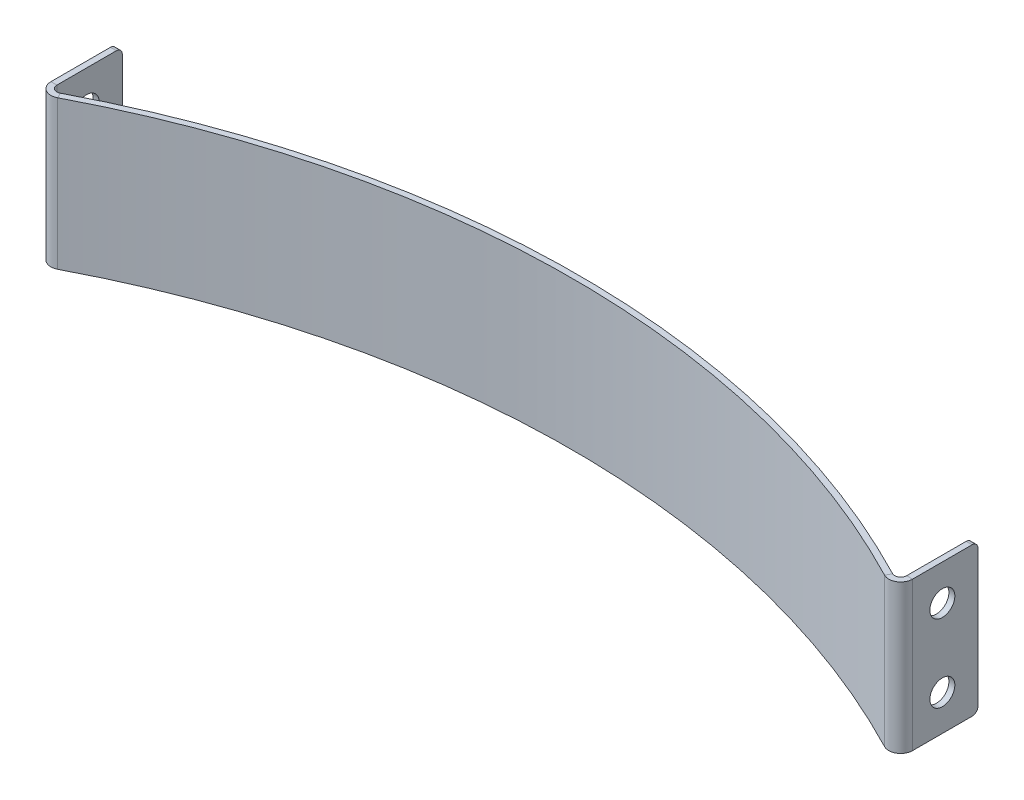
ISO-10303-21;
HEADER;
FILE_DESCRIPTION(('STEP AP214'),'2;1');
FILE_NAME('part.step','',(''),(''),'','','');
FILE_SCHEMA(('AUTOMOTIVE_DESIGN { 1 0 10303 214 1 1 1 1 }'));
ENDSEC;
DATA;
#1=APPLICATION_CONTEXT('core data for automotive mechanical design processes');
#2=APPLICATION_PROTOCOL_DEFINITION('international standard','automotive_design',2000,#1);
#3=PRODUCT_CONTEXT('',#1,'mechanical');
#4=PRODUCT('Part','Part','',(#3));
#5=PRODUCT_RELATED_PRODUCT_CATEGORY('part','',(#4));
#6=PRODUCT_DEFINITION_FORMATION('','',#4);
#7=PRODUCT_DEFINITION_CONTEXT('part definition',#1,'design');
#8=PRODUCT_DEFINITION('design','',#6,#7);
#9=PRODUCT_DEFINITION_SHAPE('','',#8);
#10=(LENGTH_UNIT() NAMED_UNIT(*) SI_UNIT(.MILLI.,.METRE.));
#11=(NAMED_UNIT(*) PLANE_ANGLE_UNIT() SI_UNIT($,.RADIAN.));
#12=(NAMED_UNIT(*) SI_UNIT($,.STERADIAN.) SOLID_ANGLE_UNIT());
#13=UNCERTAINTY_MEASURE_WITH_UNIT(LENGTH_MEASURE(1.E-05),#10,'distance_accuracy_value','');
#14=(GEOMETRIC_REPRESENTATION_CONTEXT(3) GLOBAL_UNCERTAINTY_ASSIGNED_CONTEXT((#13)) GLOBAL_UNIT_ASSIGNED_CONTEXT((#10,
#11,#12)) REPRESENTATION_CONTEXT('',''));
#15=CARTESIAN_POINT('',(0.,0.,0.));
#16=DIRECTION('',(0.,0.,1.));
#17=DIRECTION('',(1.,0.,0.));
#18=AXIS2_PLACEMENT_3D('',#15,#16,#17);
#19=CARTESIAN_POINT('',(8.04911692853238E-13,50.,4.44089209850063E-13));
#20=DIRECTION('',(0.,1.,0.));
#21=DIRECTION('',(-0.887512149902485,0.,-0.460784313725488));
#22=AXIS2_PLACEMENT_3D('',#19,#20,#21);
#23=PLANE('',#22);
#24=DIRECTION('',(0.460784313725494,0.,0.887512149902482));
#25=VECTOR('',#24,1.);
#26=CARTESIAN_POINT('',(-140.07843137255,50.,-269.803693570353));
#27=LINE('',#26,#25);
#28=CARTESIAN_POINT('',(-140.07843137255,50.,-269.803693570353));
#29=VERTEX_POINT('',#28);
#30=CARTESIAN_POINT('',(-139.156862745099,50.,-268.02866927055));
#31=VERTEX_POINT('',#30);
#32=EDGE_CURVE('E212',#29,#31,#27,.T.);
#33=ORIENTED_EDGE('',*,*,#32,.T.);
#34=CARTESIAN_POINT('',(8.04911692853238E-13,50.,4.44089209850063E-13));
#35=DIRECTION('',(0.,1.,0.));
#36=DIRECTION('',(-0.887512149902485,0.,-0.460784313725488));
#37=AXIS2_PLACEMENT_3D('',#34,#35,#36);
#38=CIRCLE('',#37,302.);
#39=CARTESIAN_POINT('',(139.156862745098,50.,-268.02866927055));
#40=VERTEX_POINT('',#39);
#41=EDGE_CURVE('E227',#31,#40,#38,.F.);
#42=ORIENTED_EDGE('',*,*,#41,.T.);
#43=DIRECTION('',(0.460784313725494,0.,-0.887512149902482));
#44=VECTOR('',#43,1.);
#45=CARTESIAN_POINT('',(139.156862745098,50.,-268.02866927055));
#46=LINE('',#45,#44);
#47=CARTESIAN_POINT('',(140.078431372549,50.,-269.803693570355));
#48=VERTEX_POINT('',#47);
#49=EDGE_CURVE('E193',#40,#48,#46,.T.);
#50=ORIENTED_EDGE('',*,*,#49,.T.);
#51=CARTESIAN_POINT('',(8.04911692853238E-13,50.,4.44089209850063E-13));
#52=DIRECTION('',(0.,-1.,0.));
#53=DIRECTION('',(0.887512149902485,0.,0.460784313725488));
#54=AXIS2_PLACEMENT_3D('',#51,#52,#53);
#55=CIRCLE('',#54,304.);
#56=EDGE_CURVE('E216',#29,#48,#55,.T.);
#57=ORIENTED_EDGE('',*,*,#56,.F.);
#58=EDGE_LOOP('',(#33,#42,#50,#57));
#59=FACE_BOUND('',#58,.T.);
#60=ADVANCED_FACE('F47',(#59),#23,.T.);
#61=CARTESIAN_POINT('',(8.04911692853238E-13,0.,4.44089209850063E-13));
#62=DIRECTION('',(0.,-1.,0.));
#63=DIRECTION('',(0.887512149902485,0.,0.460784313725488));
#64=AXIS2_PLACEMENT_3D('',#61,#62,#63);
#65=PLANE('',#64);
#66=DIRECTION('',(-0.460784313725494,0.,0.887512149902482));
#67=VECTOR('',#66,1.);
#68=CARTESIAN_POINT('',(140.078431372549,0.,-269.803693570355));
#69=LINE('',#68,#67);
#70=CARTESIAN_POINT('',(140.078431372549,0.,-269.803693570355));
#71=VERTEX_POINT('',#70);
#72=CARTESIAN_POINT('',(139.156862745098,0.,-268.02866927055));
#73=VERTEX_POINT('',#72);
#74=EDGE_CURVE('E11',#71,#73,#69,.T.);
#75=ORIENTED_EDGE('',*,*,#74,.T.);
#76=CARTESIAN_POINT('',(8.04911692853238E-13,0.,4.44089209850063E-13));
#77=DIRECTION('',(0.,1.,0.));
#78=DIRECTION('',(-0.887512149902485,0.,-0.460784313725488));
#79=AXIS2_PLACEMENT_3D('',#76,#77,#78);
#80=CIRCLE('',#79,302.);
#81=CARTESIAN_POINT('',(-139.156862745096,0.,-268.028669270549));
#82=VERTEX_POINT('',#81);
#83=EDGE_CURVE('E223',#73,#82,#80,.T.);
#84=ORIENTED_EDGE('',*,*,#83,.T.);
#85=DIRECTION('',(-0.460784313725494,0.,-0.887512149902482));
#86=VECTOR('',#85,1.);
#87=CARTESIAN_POINT('',(-139.156862745099,0.,-268.028669270548));
#88=LINE('',#87,#86);
#89=CARTESIAN_POINT('',(-140.078431372549,0.,-269.803693570353));
#90=VERTEX_POINT('',#89);
#91=EDGE_CURVE('E238',#82,#90,#88,.T.);
#92=ORIENTED_EDGE('',*,*,#91,.T.);
#93=CARTESIAN_POINT('',(8.04911692853238E-13,0.,4.44089209850063E-13));
#94=DIRECTION('',(0.,1.,0.));
#95=DIRECTION('',(-0.887512149902485,0.,-0.460784313725488));
#96=AXIS2_PLACEMENT_3D('',#93,#94,#95);
#97=CIRCLE('',#96,304.);
#98=EDGE_CURVE('E222',#71,#90,#97,.T.);
#99=ORIENTED_EDGE('',*,*,#98,.F.);
#100=EDGE_LOOP('',(#75,#84,#92,#99));
#101=FACE_BOUND('',#100,.T.);
#102=ADVANCED_FACE('F432',(#101),#65,.T.);
#103=CARTESIAN_POINT('',(8.04911692853238E-13,-269.483160619369,4.44089209850063E-13));
#104=DIRECTION('',(0.,1.,0.));
#105=DIRECTION('',(-0.887512149902485,0.,-0.460784313725488));
#106=AXIS2_PLACEMENT_3D('',#103,#104,#105);
#107=CYLINDRICAL_SURFACE('',#106,304.);
#108=ORIENTED_EDGE('',*,*,#98,.T.);
#109=DIRECTION('',(0.,-1.,0.));
#110=VECTOR('',#109,1.);
#111=CARTESIAN_POINT('',(-140.07843137255,50.,-269.803693570353));
#112=LINE('',#111,#110);
#113=EDGE_CURVE('E218',#29,#90,#112,.T.);
#114=ORIENTED_EDGE('',*,*,#113,.F.);
#115=ORIENTED_EDGE('',*,*,#56,.T.);
#116=DIRECTION('',(0.,-1.,0.));
#117=VECTOR('',#116,1.);
#118=CARTESIAN_POINT('',(140.078431372549,50.,-269.803693570355));
#119=LINE('',#118,#117);
#120=EDGE_CURVE('E204',#48,#71,#119,.T.);
#121=ORIENTED_EDGE('',*,*,#120,.T.);
#122=EDGE_LOOP('',(#108,#114,#115,#121));
#123=FACE_BOUND('',#122,.T.);
#124=ADVANCED_FACE('F217',(#123),#107,.T.);
#125=CARTESIAN_POINT('',(8.04911692853238E-13,-269.483160619369,4.44089209850063E-13));
#126=DIRECTION('',(0.,1.,0.));
#127=DIRECTION('',(-0.887512149902485,0.,-0.460784313725488));
#128=AXIS2_PLACEMENT_3D('',#125,#126,#127);
#129=CYLINDRICAL_SURFACE('',#128,302.);
#130=ORIENTED_EDGE('',*,*,#83,.F.);
#131=DIRECTION('',(0.,-1.,0.));
#132=VECTOR('',#131,1.);
#133=CARTESIAN_POINT('',(139.156862745098,50.,-268.02866927055));
#134=LINE('',#133,#132);
#135=EDGE_CURVE('E55',#40,#73,#134,.T.);
#136=ORIENTED_EDGE('',*,*,#135,.F.);
#137=ORIENTED_EDGE('',*,*,#41,.F.);
#138=DIRECTION('',(0.,-1.,0.));
#139=VECTOR('',#138,1.);
#140=CARTESIAN_POINT('',(-139.156862745099,50.,-268.028669270548));
#141=LINE('',#140,#139);
#142=EDGE_CURVE('E234',#31,#82,#141,.T.);
#143=ORIENTED_EDGE('',*,*,#142,.T.);
#144=EDGE_LOOP('',(#130,#136,#137,#143));
#145=FACE_BOUND('',#144,.T.);
#146=ADVANCED_FACE('F430',(#145),#129,.F.);
#147=CARTESIAN_POINT('',(-141.000000000001,50.,-271.578717870158));
#148=DIRECTION('',(0.,-1.,0.));
#149=DIRECTION('',(0.887512149902485,0.,0.460784313725488));
#150=AXIS2_PLACEMENT_3D('',#147,#148,#149);
#151=PLANE('',#150);
#152=DIRECTION('',(1.,0.,0.));
#153=VECTOR('',#152,1.);
#154=CARTESIAN_POINT('',(-145.000000000001,50.,-271.578717870158));
#155=LINE('',#154,#153);
#156=CARTESIAN_POINT('',(-145.000000000001,50.,-271.578717870158));
#157=VERTEX_POINT('',#156);
#158=CARTESIAN_POINT('',(-143.000000000001,50.,-271.578717870158));
#159=VERTEX_POINT('',#158);
#160=EDGE_CURVE('E254',#157,#159,#155,.T.);
#161=ORIENTED_EDGE('',*,*,#160,.F.);
#162=CARTESIAN_POINT('',(-141.000000000001,50.,-271.578717870158));
#163=DIRECTION('',(0.,1.,0.));
#164=DIRECTION('',(-0.887512149902485,0.,-0.460784313725488));
#165=AXIS2_PLACEMENT_3D('',#162,#163,#164);
#166=CIRCLE('',#165,4.);
#167=EDGE_CURVE('E72',#157,#31,#166,.T.);
#168=ORIENTED_EDGE('',*,*,#167,.T.);
#169=ORIENTED_EDGE('',*,*,#32,.F.);
#170=CARTESIAN_POINT('',(-141.000000000001,50.,-271.578717870158));
#171=DIRECTION('',(0.,1.,0.));
#172=DIRECTION('',(-0.887512149902485,0.,-0.460784313725488));
#173=AXIS2_PLACEMENT_3D('',#170,#171,#172);
#174=CIRCLE('',#173,2.);
#175=EDGE_CURVE('E258',#159,#29,#174,.T.);
#176=ORIENTED_EDGE('',*,*,#175,.F.);
#177=EDGE_LOOP('',(#161,#168,#169,#176));
#178=FACE_BOUND('',#177,.T.);
#179=ADVANCED_FACE('F447',(#178),#151,.F.);
#180=CARTESIAN_POINT('',(-141.000000000001,0.,-271.578717870158));
#181=DIRECTION('',(0.,1.,0.));
#182=DIRECTION('',(-0.887512149902485,0.,-0.460784313725488));
#183=AXIS2_PLACEMENT_3D('',#180,#181,#182);
#184=PLANE('',#183);
#185=ORIENTED_EDGE('',*,*,#91,.F.);
#186=CARTESIAN_POINT('',(-141.000000000001,0.,-271.578717870158));
#187=DIRECTION('',(0.,1.,0.));
#188=DIRECTION('',(-0.887512149902485,0.,-0.460784313725488));
#189=AXIS2_PLACEMENT_3D('',#186,#187,#188);
#190=CIRCLE('',#189,4.);
#191=CARTESIAN_POINT('',(-145.000000000001,0.,-271.578717870158));
#192=VERTEX_POINT('',#191);
#193=EDGE_CURVE('E253',#82,#192,#190,.F.);
#194=ORIENTED_EDGE('',*,*,#193,.T.);
#195=DIRECTION('',(-1.,0.,0.));
#196=VECTOR('',#195,1.);
#197=CARTESIAN_POINT('',(-143.000000000001,0.,-271.578717870158));
#198=LINE('',#197,#196);
#199=CARTESIAN_POINT('',(-143.000000000001,0.,-271.578717870158));
#200=VERTEX_POINT('',#199);
#201=EDGE_CURVE('E316',#200,#192,#198,.T.);
#202=ORIENTED_EDGE('',*,*,#201,.F.);
#203=CARTESIAN_POINT('',(-141.000000000001,0.,-271.578717870158));
#204=DIRECTION('',(0.,-1.,0.));
#205=DIRECTION('',(0.887512149902485,0.,0.460784313725488));
#206=AXIS2_PLACEMENT_3D('',#203,#204,#205);
#207=CIRCLE('',#206,2.);
#208=EDGE_CURVE('E246',#90,#200,#207,.T.);
#209=ORIENTED_EDGE('',*,*,#208,.F.);
#210=EDGE_LOOP('',(#185,#194,#202,#209));
#211=FACE_BOUND('',#210,.T.);
#212=ADVANCED_FACE('F436',(#211),#184,.F.);
#213=CARTESIAN_POINT('',(-141.000000000001,-25.6454305624721,-271.578717870158));
#214=DIRECTION('',(0.,1.,0.));
#215=DIRECTION('',(-0.887512149902485,0.,-0.460784313725488));
#216=AXIS2_PLACEMENT_3D('',#213,#214,#215);
#217=CYLINDRICAL_SURFACE('',#216,2.);
#218=ORIENTED_EDGE('',*,*,#208,.T.);
#219=DIRECTION('',(0.,-1.,0.));
#220=VECTOR('',#219,1.);
#221=CARTESIAN_POINT('',(-143.000000000001,50.,-271.578717870158));
#222=LINE('',#221,#220);
#223=EDGE_CURVE('E305',#159,#200,#222,.T.);
#224=ORIENTED_EDGE('',*,*,#223,.F.);
#225=ORIENTED_EDGE('',*,*,#175,.T.);
#226=ORIENTED_EDGE('',*,*,#113,.T.);
#227=EDGE_LOOP('',(#218,#224,#225,#226));
#228=FACE_BOUND('',#227,.T.);
#229=ADVANCED_FACE('F469',(#228),#217,.F.);
#230=CARTESIAN_POINT('',(-141.000000000001,-25.6454305624721,-271.578717870158));
#231=DIRECTION('',(0.,1.,0.));
#232=DIRECTION('',(-0.887512149902485,0.,-0.460784313725488));
#233=AXIS2_PLACEMENT_3D('',#230,#231,#232);
#234=CYLINDRICAL_SURFACE('',#233,4.);
#235=ORIENTED_EDGE('',*,*,#193,.F.);
#236=ORIENTED_EDGE('',*,*,#142,.F.);
#237=ORIENTED_EDGE('',*,*,#167,.F.);
#238=DIRECTION('',(0.,-1.,0.));
#239=VECTOR('',#238,1.);
#240=CARTESIAN_POINT('',(-145.000000000001,50.,-271.578717870158));
#241=LINE('',#240,#239);
#242=EDGE_CURVE('E264',#157,#192,#241,.T.);
#243=ORIENTED_EDGE('',*,*,#242,.T.);
#244=EDGE_LOOP('',(#235,#236,#237,#243));
#245=FACE_BOUND('',#244,.T.);
#246=ADVANCED_FACE('F439',(#245),#234,.T.);
#247=CARTESIAN_POINT('',(-145.000000000001,48.,-291.609999999998));
#248=DIRECTION('',(1.,0.,0.));
#249=DIRECTION('',(0.,0.,-1.));
#250=AXIS2_PLACEMENT_3D('',#247,#248,#249);
#251=CYLINDRICAL_SURFACE('',#250,2.);
#252=CARTESIAN_POINT('',(-145.000000000001,48.,-291.609999999998));
#253=DIRECTION('',(1.,0.,0.));
#254=DIRECTION('',(0.,0.,-1.));
#255=AXIS2_PLACEMENT_3D('',#252,#253,#254);
#256=CIRCLE('',#255,2.);
#257=CARTESIAN_POINT('',(-145.000000000001,50.,-291.609999999998));
#258=VERTEX_POINT('',#257);
#259=CARTESIAN_POINT('',(-145.000000000001,48.,-293.609999999998));
#260=VERTEX_POINT('',#259);
#261=EDGE_CURVE('E330',#258,#260,#256,.F.);
#262=ORIENTED_EDGE('',*,*,#261,.F.);
#263=DIRECTION('',(1.,0.,0.));
#264=VECTOR('',#263,1.);
#265=CARTESIAN_POINT('',(-140.07843137255,50.,-291.609999999998));
#266=LINE('',#265,#264);
#267=CARTESIAN_POINT('',(-143.000000000001,50.,-291.609999999998));
#268=VERTEX_POINT('',#267);
#269=EDGE_CURVE('E333',#268,#258,#266,.F.);
#270=ORIENTED_EDGE('',*,*,#269,.F.);
#271=CARTESIAN_POINT('',(-143.000000000001,48.,-291.609999999998));
#272=DIRECTION('',(1.,0.,0.));
#273=DIRECTION('',(0.,0.,-1.));
#274=AXIS2_PLACEMENT_3D('',#271,#272,#273);
#275=CIRCLE('',#274,2.);
#276=CARTESIAN_POINT('',(-143.000000000001,48.,-293.609999999998));
#277=VERTEX_POINT('',#276);
#278=EDGE_CURVE('E299',#277,#268,#275,.T.);
#279=ORIENTED_EDGE('',*,*,#278,.F.);
#280=DIRECTION('',(1.,0.,0.));
#281=VECTOR('',#280,1.);
#282=CARTESIAN_POINT('',(-145.000000000001,48.,-293.609999999998));
#283=LINE('',#282,#281);
#284=EDGE_CURVE('E276',#260,#277,#283,.T.);
#285=ORIENTED_EDGE('',*,*,#284,.F.);
#286=EDGE_LOOP('',(#262,#270,#279,#285));
#287=FACE_BOUND('',#286,.T.);
#288=ADVANCED_FACE('F454',(#287),#251,.T.);
#289=CARTESIAN_POINT('',(-145.000000000001,50.,-293.609999999998));
#290=DIRECTION('',(0.,0.,-1.));
#291=DIRECTION('',(-1.,0.,0.));
#292=AXIS2_PLACEMENT_3D('',#289,#290,#291);
#293=PLANE('',#292);
#294=DIRECTION('',(0.,-1.,0.));
#295=VECTOR('',#294,1.);
#296=CARTESIAN_POINT('',(-143.000000000001,50.,-293.609999999998));
#297=LINE('',#296,#295);
#298=CARTESIAN_POINT('',(-143.000000000001,1.99999999999999,-293.609999999998));
#299=VERTEX_POINT('',#298);
#300=EDGE_CURVE('E268',#277,#299,#297,.T.);
#301=ORIENTED_EDGE('',*,*,#300,.T.);
#302=DIRECTION('',(1.,0.,0.));
#303=VECTOR('',#302,1.);
#304=CARTESIAN_POINT('',(-145.000000000001,2.,-293.609999999998));
#305=LINE('',#304,#303);
#306=CARTESIAN_POINT('',(-145.000000000001,1.99999999999999,-293.609999999998));
#307=VERTEX_POINT('',#306);
#308=EDGE_CURVE('E273',#299,#307,#305,.F.);
#309=ORIENTED_EDGE('',*,*,#308,.T.);
#310=DIRECTION('',(0.,-1.,0.));
#311=VECTOR('',#310,1.);
#312=CARTESIAN_POINT('',(-145.000000000001,50.,-293.609999999998));
#313=LINE('',#312,#311);
#314=EDGE_CURVE('E320',#260,#307,#313,.T.);
#315=ORIENTED_EDGE('',*,*,#314,.F.);
#316=ORIENTED_EDGE('',*,*,#284,.T.);
#317=EDGE_LOOP('',(#301,#309,#315,#316));
#318=FACE_BOUND('',#317,.T.);
#319=ADVANCED_FACE('F459',(#318),#293,.T.);
#320=CARTESIAN_POINT('',(140.999999999999,2.,-291.609999999998));
#321=DIRECTION('',(-1.,0.,0.));
#322=DIRECTION('',(0.,0.,1.));
#323=AXIS2_PLACEMENT_3D('',#320,#321,#322);
#324=CYLINDRICAL_SURFACE('',#323,2.);
#325=CARTESIAN_POINT('',(-145.000000000001,2.,-291.609999999998));
#326=DIRECTION('',(1.,0.,0.));
#327=DIRECTION('',(0.,0.,-1.));
#328=AXIS2_PLACEMENT_3D('',#325,#326,#327);
#329=CIRCLE('',#328,2.);
#330=CARTESIAN_POINT('',(-145.000000000001,0.,-291.609999999998));
#331=VERTEX_POINT('',#330);
#332=EDGE_CURVE('E324',#307,#331,#329,.F.);
#333=ORIENTED_EDGE('',*,*,#332,.F.);
#334=ORIENTED_EDGE('',*,*,#308,.F.);
#335=CARTESIAN_POINT('',(-143.000000000001,2.,-291.609999999998));
#336=DIRECTION('',(1.,0.,0.));
#337=DIRECTION('',(0.,0.,-1.));
#338=AXIS2_PLACEMENT_3D('',#335,#336,#337);
#339=CIRCLE('',#338,2.);
#340=CARTESIAN_POINT('',(-143.000000000001,0.,-291.609999999998));
#341=VERTEX_POINT('',#340);
#342=EDGE_CURVE('E296',#341,#299,#339,.T.);
#343=ORIENTED_EDGE('',*,*,#342,.F.);
#344=DIRECTION('',(1.,0.,0.));
#345=VECTOR('',#344,1.);
#346=CARTESIAN_POINT('',(-143.000000000001,0.,-291.609999999998));
#347=LINE('',#346,#345);
#348=EDGE_CURVE('E308',#331,#341,#347,.T.);
#349=ORIENTED_EDGE('',*,*,#348,.F.);
#350=EDGE_LOOP('',(#333,#334,#343,#349));
#351=FACE_BOUND('',#350,.T.);
#352=ADVANCED_FACE('F463',(#351),#324,.T.);
#353=CARTESIAN_POINT('',(-145.000000000001,38.,-281.609999999998));
#354=DIRECTION('',(-1.,0.,0.));
#355=DIRECTION('',(0.,0.,1.));
#356=AXIS2_PLACEMENT_3D('',#353,#354,#355);
#357=CYLINDRICAL_SURFACE('',#356,4.2);
#358=CARTESIAN_POINT('',(-145.000000000001,38.,-281.609999999998));
#359=DIRECTION('',(-1.,0.,0.));
#360=DIRECTION('',(0.,0.,1.));
#361=AXIS2_PLACEMENT_3D('',#358,#359,#360);
#362=CIRCLE('',#361,4.19999999999999);
#363=CARTESIAN_POINT('',(-145.000000000001,38.,-277.409999999998));
#364=VERTEX_POINT('',#363);
#365=EDGE_CURVE('E280',#364,#364,#362,.T.);
#366=ORIENTED_EDGE('',*,*,#365,.T.);
#367=EDGE_LOOP('',(#366));
#368=FACE_BOUND('',#367,.T.);
#369=CARTESIAN_POINT('',(-143.000000000001,38.,-281.609999999998));
#370=DIRECTION('',(1.,0.,0.));
#371=DIRECTION('',(0.,0.,-1.));
#372=AXIS2_PLACEMENT_3D('',#369,#370,#371);
#373=CIRCLE('',#372,4.2);
#374=CARTESIAN_POINT('',(-143.000000000001,38.,-285.809999999998));
#375=VERTEX_POINT('',#374);
#376=EDGE_CURVE('E284',#375,#375,#373,.T.);
#377=ORIENTED_EDGE('',*,*,#376,.T.);
#378=EDGE_LOOP('',(#377));
#379=FACE_BOUND('',#378,.T.);
#380=ADVANCED_FACE('F481',(#368,#379),#357,.F.);
#381=CARTESIAN_POINT('',(-145.000000000001,12.,-281.609999999998));
#382=DIRECTION('',(-1.,0.,0.));
#383=DIRECTION('',(0.,0.,1.));
#384=AXIS2_PLACEMENT_3D('',#381,#382,#383);
#385=CYLINDRICAL_SURFACE('',#384,4.2);
#386=CARTESIAN_POINT('',(-145.000000000001,12.,-281.609999999998));
#387=DIRECTION('',(-1.,0.,0.));
#388=DIRECTION('',(0.,0.,1.));
#389=AXIS2_PLACEMENT_3D('',#386,#387,#388);
#390=CIRCLE('',#389,4.19999999999999);
#391=CARTESIAN_POINT('',(-145.000000000001,12.,-277.409999999998));
#392=VERTEX_POINT('',#391);
#393=EDGE_CURVE('E288',#392,#392,#390,.T.);
#394=ORIENTED_EDGE('',*,*,#393,.T.);
#395=EDGE_LOOP('',(#394));
#396=FACE_BOUND('',#395,.T.);
#397=CARTESIAN_POINT('',(-143.000000000001,12.,-281.609999999998));
#398=DIRECTION('',(1.,0.,0.));
#399=DIRECTION('',(0.,0.,-1.));
#400=AXIS2_PLACEMENT_3D('',#397,#398,#399);
#401=CIRCLE('',#400,4.2);
#402=CARTESIAN_POINT('',(-143.000000000001,12.,-285.809999999998));
#403=VERTEX_POINT('',#402);
#404=EDGE_CURVE('E292',#403,#403,#401,.T.);
#405=ORIENTED_EDGE('',*,*,#404,.T.);
#406=EDGE_LOOP('',(#405));
#407=FACE_BOUND('',#406,.T.);
#408=ADVANCED_FACE('F473',(#396,#407),#385,.F.);
#409=CARTESIAN_POINT('',(-143.000000000001,50.,-264.913193329436));
#410=DIRECTION('',(1.,0.,0.));
#411=DIRECTION('',(0.,0.,-1.));
#412=AXIS2_PLACEMENT_3D('',#409,#410,#411);
#413=PLANE('',#412);
#414=ORIENTED_EDGE('',*,*,#404,.F.);
#415=EDGE_LOOP('',(#414));
#416=FACE_BOUND('',#415,.T.);
#417=ORIENTED_EDGE('',*,*,#376,.F.);
#418=EDGE_LOOP('',(#417));
#419=FACE_BOUND('',#418,.T.);
#420=DIRECTION('',(0.,0.,-1.));
#421=VECTOR('',#420,1.);
#422=CARTESIAN_POINT('',(-143.000000000001,0.,-264.913193329436));
#423=LINE('',#422,#421);
#424=EDGE_CURVE('E312',#341,#200,#423,.F.);
#425=ORIENTED_EDGE('',*,*,#424,.F.);
#426=ORIENTED_EDGE('',*,*,#342,.T.);
#427=ORIENTED_EDGE('',*,*,#300,.F.);
#428=ORIENTED_EDGE('',*,*,#278,.T.);
#429=DIRECTION('',(0.,0.,-1.));
#430=VECTOR('',#429,1.);
#431=CARTESIAN_POINT('',(-143.000000000001,50.,-264.913193329436));
#432=LINE('',#431,#430);
#433=EDGE_CURVE('E302',#268,#159,#432,.F.);
#434=ORIENTED_EDGE('',*,*,#433,.T.);
#435=ORIENTED_EDGE('',*,*,#223,.T.);
#436=EDGE_LOOP('',(#425,#426,#427,#428,#434,#435));
#437=FACE_BOUND('',#436,.T.);
#438=ADVANCED_FACE('F471',(#416,#419,#437),#413,.T.);
#439=CARTESIAN_POINT('',(140.999999999999,0.,-271.578717870158));
#440=DIRECTION('',(0.,1.,0.));
#441=DIRECTION('',(1.,0.,0.));
#442=AXIS2_PLACEMENT_3D('',#439,#440,#441);
#443=PLANE('',#442);
#444=DIRECTION('',(0.,0.,1.));
#445=VECTOR('',#444,1.);
#446=CARTESIAN_POINT('',(-145.000000000001,0.,-264.913193329435));
#447=LINE('',#446,#445);
#448=EDGE_CURVE('E327',#331,#192,#447,.T.);
#449=ORIENTED_EDGE('',*,*,#448,.F.);
#450=ORIENTED_EDGE('',*,*,#348,.T.);
#451=ORIENTED_EDGE('',*,*,#424,.T.);
#452=ORIENTED_EDGE('',*,*,#201,.T.);
#453=EDGE_LOOP('',(#449,#450,#451,#452));
#454=FACE_BOUND('',#453,.T.);
#455=ADVANCED_FACE('F466',(#454),#443,.F.);
#456=CARTESIAN_POINT('',(-145.000000000001,50.,-264.913193329435));
#457=DIRECTION('',(1.,0.,0.));
#458=DIRECTION('',(0.,0.,-1.));
#459=AXIS2_PLACEMENT_3D('',#456,#457,#458);
#460=PLANE('',#459);
#461=ORIENTED_EDGE('',*,*,#393,.F.);
#462=EDGE_LOOP('',(#461));
#463=FACE_BOUND('',#462,.T.);
#464=ORIENTED_EDGE('',*,*,#365,.F.);
#465=EDGE_LOOP('',(#464));
#466=FACE_BOUND('',#465,.T.);
#467=ORIENTED_EDGE('',*,*,#314,.T.);
#468=ORIENTED_EDGE('',*,*,#332,.T.);
#469=ORIENTED_EDGE('',*,*,#448,.T.);
#470=ORIENTED_EDGE('',*,*,#242,.F.);
#471=DIRECTION('',(0.,0.,1.));
#472=VECTOR('',#471,1.);
#473=CARTESIAN_POINT('',(-145.000000000001,50.,-264.913193329435));
#474=LINE('',#473,#472);
#475=EDGE_CURVE('E336',#258,#157,#474,.T.);
#476=ORIENTED_EDGE('',*,*,#475,.F.);
#477=ORIENTED_EDGE('',*,*,#261,.T.);
#478=EDGE_LOOP('',(#467,#468,#469,#470,#476,#477));
#479=FACE_BOUND('',#478,.T.);
#480=ADVANCED_FACE('F443',(#463,#466,#479),#460,.F.);
#481=CARTESIAN_POINT('',(-140.07843137255,50.,-269.803693570353));
#482=DIRECTION('',(0.,1.,0.));
#483=DIRECTION('',(0.,0.,1.));
#484=AXIS2_PLACEMENT_3D('',#481,#482,#483);
#485=PLANE('',#484);
#486=ORIENTED_EDGE('',*,*,#433,.F.);
#487=ORIENTED_EDGE('',*,*,#269,.T.);
#488=ORIENTED_EDGE('',*,*,#475,.T.);
#489=ORIENTED_EDGE('',*,*,#160,.T.);
#490=EDGE_LOOP('',(#486,#487,#488,#489));
#491=FACE_BOUND('',#490,.T.);
#492=ADVANCED_FACE('F451',(#491),#485,.T.);
#493=CARTESIAN_POINT('',(143.,48.,-291.61));
#494=DIRECTION('',(1.,0.,0.));
#495=DIRECTION('',(0.,0.,-1.));
#496=AXIS2_PLACEMENT_3D('',#493,#494,#495);
#497=CYLINDRICAL_SURFACE('',#496,2.);
#498=CARTESIAN_POINT('',(143.,48.,-291.61));
#499=DIRECTION('',(-1.,0.,0.));
#500=DIRECTION('',(0.,0.,1.));
#501=AXIS2_PLACEMENT_3D('',#498,#499,#500);
#502=CIRCLE('',#501,2.);
#503=CARTESIAN_POINT('',(143.,50.,-291.61));
#504=VERTEX_POINT('',#503);
#505=CARTESIAN_POINT('',(143.,48.,-293.61));
#506=VERTEX_POINT('',#505);
#507=EDGE_CURVE('E382',#504,#506,#502,.T.);
#508=ORIENTED_EDGE('',*,*,#507,.F.);
#509=DIRECTION('',(1.,0.,0.));
#510=VECTOR('',#509,1.);
#511=CARTESIAN_POINT('',(141.,50.,-291.61));
#512=LINE('',#511,#510);
#513=CARTESIAN_POINT('',(145.,50.,-291.61));
#514=VERTEX_POINT('',#513);
#515=EDGE_CURVE('E389',#514,#504,#512,.F.);
#516=ORIENTED_EDGE('',*,*,#515,.F.);
#517=CARTESIAN_POINT('',(145.,48.,-291.61));
#518=DIRECTION('',(-1.,0.,0.));
#519=DIRECTION('',(0.,0.,1.));
#520=AXIS2_PLACEMENT_3D('',#517,#518,#519);
#521=CIRCLE('',#520,2.);
#522=CARTESIAN_POINT('',(145.,48.,-293.61));
#523=VERTEX_POINT('',#522);
#524=EDGE_CURVE('E401',#523,#514,#521,.F.);
#525=ORIENTED_EDGE('',*,*,#524,.F.);
#526=DIRECTION('',(1.,0.,0.));
#527=VECTOR('',#526,1.);
#528=CARTESIAN_POINT('',(143.,48.,-293.61));
#529=LINE('',#528,#527);
#530=EDGE_CURVE('E351',#506,#523,#529,.T.);
#531=ORIENTED_EDGE('',*,*,#530,.F.);
#532=EDGE_LOOP('',(#508,#516,#525,#531));
#533=FACE_BOUND('',#532,.T.);
#534=ADVANCED_FACE('F507',(#533),#497,.T.);
#535=CARTESIAN_POINT('',(140.078431372549,2.,-291.61));
#536=DIRECTION('',(1.,0.,0.));
#537=DIRECTION('',(0.,0.,-1.));
#538=AXIS2_PLACEMENT_3D('',#535,#536,#537);
#539=CYLINDRICAL_SURFACE('',#538,2.);
#540=CARTESIAN_POINT('',(143.,2.,-291.61));
#541=DIRECTION('',(-1.,0.,0.));
#542=DIRECTION('',(0.,0.,1.));
#543=AXIS2_PLACEMENT_3D('',#540,#541,#542);
#544=CIRCLE('',#543,2.);
#545=CARTESIAN_POINT('',(143.,2.,-293.61));
#546=VERTEX_POINT('',#545);
#547=CARTESIAN_POINT('',(143.,0.,-291.61));
#548=VERTEX_POINT('',#547);
#549=EDGE_CURVE('E375',#546,#548,#544,.T.);
#550=ORIENTED_EDGE('',*,*,#549,.F.);
#551=DIRECTION('',(1.,0.,0.));
#552=VECTOR('',#551,1.);
#553=CARTESIAN_POINT('',(143.,2.,-293.61));
#554=LINE('',#553,#552);
#555=CARTESIAN_POINT('',(145.,2.,-293.61));
#556=VERTEX_POINT('',#555);
#557=EDGE_CURVE('E348',#556,#546,#554,.F.);
#558=ORIENTED_EDGE('',*,*,#557,.F.);
#559=CARTESIAN_POINT('',(145.,2.,-291.61));
#560=DIRECTION('',(-1.,0.,0.));
#561=DIRECTION('',(0.,0.,1.));
#562=AXIS2_PLACEMENT_3D('',#559,#560,#561);
#563=CIRCLE('',#562,2.);
#564=CARTESIAN_POINT('',(145.,0.,-291.61));
#565=VERTEX_POINT('',#564);
#566=EDGE_CURVE('E398',#565,#556,#563,.F.);
#567=ORIENTED_EDGE('',*,*,#566,.F.);
#568=DIRECTION('',(1.,0.,0.));
#569=VECTOR('',#568,1.);
#570=CARTESIAN_POINT('',(140.078431372549,0.,-291.61));
#571=LINE('',#570,#569);
#572=EDGE_CURVE('E412',#548,#565,#571,.T.);
#573=ORIENTED_EDGE('',*,*,#572,.F.);
#574=EDGE_LOOP('',(#550,#558,#567,#573));
#575=FACE_BOUND('',#574,.T.);
#576=ADVANCED_FACE('F556',(#575),#539,.T.);
#577=CARTESIAN_POINT('',(143.,50.,-293.61));
#578=DIRECTION('',(0.,0.,-1.));
#579=DIRECTION('',(-1.,0.,0.));
#580=AXIS2_PLACEMENT_3D('',#577,#578,#579);
#581=PLANE('',#580);
#582=DIRECTION('',(0.,-1.,0.));
#583=VECTOR('',#582,1.);
#584=CARTESIAN_POINT('',(145.,50.,-293.61));
#585=LINE('',#584,#583);
#586=EDGE_CURVE('E344',#523,#556,#585,.T.);
#587=ORIENTED_EDGE('',*,*,#586,.T.);
#588=ORIENTED_EDGE('',*,*,#557,.T.);
#589=DIRECTION('',(0.,-1.,0.));
#590=VECTOR('',#589,1.);
#591=CARTESIAN_POINT('',(143.,50.,-293.61));
#592=LINE('',#591,#590);
#593=EDGE_CURVE('E371',#506,#546,#592,.T.);
#594=ORIENTED_EDGE('',*,*,#593,.F.);
#595=ORIENTED_EDGE('',*,*,#530,.T.);
#596=EDGE_LOOP('',(#587,#588,#594,#595));
#597=FACE_BOUND('',#596,.T.);
#598=ADVANCED_FACE('F552',(#597),#581,.T.);
#599=CARTESIAN_POINT('',(145.000000000003,38.,-281.61));
#600=DIRECTION('',(1.,0.,0.));
#601=DIRECTION('',(0.,0.,-1.));
#602=AXIS2_PLACEMENT_3D('',#599,#600,#601);
#603=CYLINDRICAL_SURFACE('',#602,4.2);
#604=CARTESIAN_POINT('',(145.000000000003,38.,-281.61));
#605=DIRECTION('',(1.,0.,0.));
#606=DIRECTION('',(0.,0.,-1.));
#607=AXIS2_PLACEMENT_3D('',#604,#605,#606);
#608=CIRCLE('',#607,4.19999999999999);
#609=CARTESIAN_POINT('',(145.000000000003,38.,-285.81));
#610=VERTEX_POINT('',#609);
#611=EDGE_CURVE('E355',#610,#610,#608,.T.);
#612=ORIENTED_EDGE('',*,*,#611,.T.);
#613=EDGE_LOOP('',(#612));
#614=FACE_BOUND('',#613,.T.);
#615=CARTESIAN_POINT('',(143.,38.,-281.61));
#616=DIRECTION('',(-1.,0.,0.));
#617=DIRECTION('',(0.,0.,1.));
#618=AXIS2_PLACEMENT_3D('',#615,#616,#617);
#619=CIRCLE('',#618,4.2);
#620=CARTESIAN_POINT('',(143.,38.,-277.41));
#621=VERTEX_POINT('',#620);
#622=EDGE_CURVE('E359',#621,#621,#619,.T.);
#623=ORIENTED_EDGE('',*,*,#622,.T.);
#624=EDGE_LOOP('',(#623));
#625=FACE_BOUND('',#624,.T.);
#626=ADVANCED_FACE('F548',(#614,#625),#603,.F.);
#627=CARTESIAN_POINT('',(145.000000000003,12.,-281.61));
#628=DIRECTION('',(1.,0.,0.));
#629=DIRECTION('',(0.,0.,-1.));
#630=AXIS2_PLACEMENT_3D('',#627,#628,#629);
#631=CYLINDRICAL_SURFACE('',#630,4.19999999999999);
#632=CARTESIAN_POINT('',(145.000000000003,12.,-281.61));
#633=DIRECTION('',(1.,0.,0.));
#634=DIRECTION('',(0.,0.,-1.));
#635=AXIS2_PLACEMENT_3D('',#632,#633,#634);
#636=CIRCLE('',#635,4.19999999999999);
#637=CARTESIAN_POINT('',(145.000000000003,12.,-285.81));
#638=VERTEX_POINT('',#637);
#639=EDGE_CURVE('E363',#638,#638,#636,.T.);
#640=ORIENTED_EDGE('',*,*,#639,.T.);
#641=EDGE_LOOP('',(#640));
#642=FACE_BOUND('',#641,.T.);
#643=CARTESIAN_POINT('',(143.,12.,-281.61));
#644=DIRECTION('',(-1.,0.,0.));
#645=DIRECTION('',(0.,0.,1.));
#646=AXIS2_PLACEMENT_3D('',#643,#644,#645);
#647=CIRCLE('',#646,4.19999999999999);
#648=CARTESIAN_POINT('',(143.,12.,-277.41));
#649=VERTEX_POINT('',#648);
#650=EDGE_CURVE('E367',#649,#649,#647,.T.);
#651=ORIENTED_EDGE('',*,*,#650,.T.);
#652=EDGE_LOOP('',(#651));
#653=FACE_BOUND('',#652,.T.);
#654=ADVANCED_FACE('F544',(#642,#653),#631,.F.);
#655=CARTESIAN_POINT('',(143.,50.,-264.913193329438));
#656=DIRECTION('',(-1.,0.,0.));
#657=DIRECTION('',(0.,0.,1.));
#658=AXIS2_PLACEMENT_3D('',#655,#656,#657);
#659=PLANE('',#658);
#660=ORIENTED_EDGE('',*,*,#650,.F.);
#661=EDGE_LOOP('',(#660));
#662=FACE_BOUND('',#661,.T.);
#663=ORIENTED_EDGE('',*,*,#622,.F.);
#664=EDGE_LOOP('',(#663));
#665=FACE_BOUND('',#664,.T.);
#666=ORIENTED_EDGE('',*,*,#593,.T.);
#667=ORIENTED_EDGE('',*,*,#549,.T.);
#668=DIRECTION('',(0.,0.,-1.));
#669=VECTOR('',#668,1.);
#670=CARTESIAN_POINT('',(143.,0.,-264.913193329438));
#671=LINE('',#670,#669);
#672=CARTESIAN_POINT('',(143.,0.,-271.57871787016));
#673=VERTEX_POINT('',#672);
#674=EDGE_CURVE('E408',#673,#548,#671,.T.);
#675=ORIENTED_EDGE('',*,*,#674,.F.);
#676=DIRECTION('',(0.,-1.,0.));
#677=VECTOR('',#676,1.);
#678=CARTESIAN_POINT('',(143.,50.,-271.57871787016));
#679=LINE('',#678,#677);
#680=CARTESIAN_POINT('',(143.,50.,-271.57871787016));
#681=VERTEX_POINT('',#680);
#682=EDGE_CURVE('E341',#681,#673,#679,.T.);
#683=ORIENTED_EDGE('',*,*,#682,.F.);
#684=DIRECTION('',(0.,0.,-1.));
#685=VECTOR('',#684,1.);
#686=CARTESIAN_POINT('',(143.,50.,-264.913193329438));
#687=LINE('',#686,#685);
#688=EDGE_CURVE('E378',#681,#504,#687,.T.);
#689=ORIENTED_EDGE('',*,*,#688,.T.);
#690=ORIENTED_EDGE('',*,*,#507,.T.);
#691=EDGE_LOOP('',(#666,#667,#675,#683,#689,#690));
#692=FACE_BOUND('',#691,.T.);
#693=ADVANCED_FACE('F540',(#662,#665,#692),#659,.T.);
#694=CARTESIAN_POINT('',(141.,50.,-271.57871787016));
#695=DIRECTION('',(0.,1.,0.));
#696=DIRECTION('',(1.,0.,0.));
#697=AXIS2_PLACEMENT_3D('',#694,#695,#696);
#698=PLANE('',#697);
#699=DIRECTION('',(0.,0.,-1.));
#700=VECTOR('',#699,1.);
#701=CARTESIAN_POINT('',(145.,50.,-264.913193329438));
#702=LINE('',#701,#700);
#703=CARTESIAN_POINT('',(145.,50.,-271.57871787016));
#704=VERTEX_POINT('',#703);
#705=EDGE_CURVE('E385',#704,#514,#702,.T.);
#706=ORIENTED_EDGE('',*,*,#705,.T.);
#707=ORIENTED_EDGE('',*,*,#515,.T.);
#708=ORIENTED_EDGE('',*,*,#688,.F.);
#709=DIRECTION('',(1.,0.,0.));
#710=VECTOR('',#709,1.);
#711=CARTESIAN_POINT('',(143.,50.,-271.57871787016));
#712=LINE('',#711,#710);
#713=EDGE_CURVE('E195',#681,#704,#712,.T.);
#714=ORIENTED_EDGE('',*,*,#713,.T.);
#715=EDGE_LOOP('',(#706,#707,#708,#714));
#716=FACE_BOUND('',#715,.T.);
#717=ADVANCED_FACE('F536',(#716),#698,.T.);
#718=CARTESIAN_POINT('',(145.,50.,-264.913193329438));
#719=DIRECTION('',(-1.,0.,0.));
#720=DIRECTION('',(0.,0.,1.));
#721=AXIS2_PLACEMENT_3D('',#718,#719,#720);
#722=PLANE('',#721);
#723=ORIENTED_EDGE('',*,*,#639,.F.);
#724=EDGE_LOOP('',(#723));
#725=FACE_BOUND('',#724,.T.);
#726=ORIENTED_EDGE('',*,*,#611,.F.);
#727=EDGE_LOOP('',(#726));
#728=FACE_BOUND('',#727,.T.);
#729=DIRECTION('',(0.,0.,-1.));
#730=VECTOR('',#729,1.);
#731=CARTESIAN_POINT('',(145.,0.,-264.913193329438));
#732=LINE('',#731,#730);
#733=CARTESIAN_POINT('',(145.,0.,-271.57871787016));
#734=VERTEX_POINT('',#733);
#735=EDGE_CURVE('E394',#734,#565,#732,.T.);
#736=ORIENTED_EDGE('',*,*,#735,.T.);
#737=ORIENTED_EDGE('',*,*,#566,.T.);
#738=ORIENTED_EDGE('',*,*,#586,.F.);
#739=ORIENTED_EDGE('',*,*,#524,.T.);
#740=ORIENTED_EDGE('',*,*,#705,.F.);
#741=DIRECTION('',(0.,-1.,0.));
#742=VECTOR('',#741,1.);
#743=CARTESIAN_POINT('',(145.,50.,-271.57871787016));
#744=LINE('',#743,#742);
#745=EDGE_CURVE('E404',#704,#734,#744,.T.);
#746=ORIENTED_EDGE('',*,*,#745,.T.);
#747=EDGE_LOOP('',(#736,#737,#738,#739,#740,#746));
#748=FACE_BOUND('',#747,.T.);
#749=ADVANCED_FACE('F532',(#725,#728,#748),#722,.F.);
#750=CARTESIAN_POINT('',(140.078431372549,0.,-269.803693570355));
#751=DIRECTION('',(0.,-1.,0.));
#752=DIRECTION('',(0.,0.,-1.));
#753=AXIS2_PLACEMENT_3D('',#750,#751,#752);
#754=PLANE('',#753);
#755=ORIENTED_EDGE('',*,*,#674,.T.);
#756=ORIENTED_EDGE('',*,*,#572,.T.);
#757=ORIENTED_EDGE('',*,*,#735,.F.);
#758=DIRECTION('',(-1.,0.,0.));
#759=VECTOR('',#758,1.);
#760=CARTESIAN_POINT('',(145.,0.,-271.57871787016));
#761=LINE('',#760,#759);
#762=EDGE_CURVE('E269',#734,#673,#761,.T.);
#763=ORIENTED_EDGE('',*,*,#762,.T.);
#764=EDGE_LOOP('',(#755,#756,#757,#763));
#765=FACE_BOUND('',#764,.T.);
#766=ADVANCED_FACE('F529',(#765),#754,.T.);
#767=CARTESIAN_POINT('',(141.,50.,-271.57871787016));
#768=DIRECTION('',(0.,-1.,0.));
#769=DIRECTION('',(0.,0.,-1.));
#770=AXIS2_PLACEMENT_3D('',#767,#768,#769);
#771=PLANE('',#770);
#772=ORIENTED_EDGE('',*,*,#49,.F.);
#773=CARTESIAN_POINT('',(141.,50.,-271.57871787016));
#774=DIRECTION('',(0.,1.,0.));
#775=DIRECTION('',(0.,0.,1.));
#776=AXIS2_PLACEMENT_3D('',#773,#774,#775);
#777=CIRCLE('',#776,4.);
#778=EDGE_CURVE('E419',#40,#704,#777,.T.);
#779=ORIENTED_EDGE('',*,*,#778,.T.);
#780=ORIENTED_EDGE('',*,*,#713,.F.);
#781=CARTESIAN_POINT('',(141.,50.,-271.57871787016));
#782=DIRECTION('',(0.,1.,0.));
#783=DIRECTION('',(0.,0.,1.));
#784=AXIS2_PLACEMENT_3D('',#781,#782,#783);
#785=CIRCLE('',#784,2.00000000000001);
#786=EDGE_CURVE('E189',#48,#681,#785,.T.);
#787=ORIENTED_EDGE('',*,*,#786,.F.);
#788=EDGE_LOOP('',(#772,#779,#780,#787));
#789=FACE_BOUND('',#788,.T.);
#790=ADVANCED_FACE('F191',(#789),#771,.F.);
#791=CARTESIAN_POINT('',(141.,0.,-271.57871787016));
#792=DIRECTION('',(0.,1.,0.));
#793=DIRECTION('',(0.,0.,1.));
#794=AXIS2_PLACEMENT_3D('',#791,#792,#793);
#795=PLANE('',#794);
#796=ORIENTED_EDGE('',*,*,#762,.F.);
#797=CARTESIAN_POINT('',(141.,0.,-271.57871787016));
#798=DIRECTION('',(0.,1.,0.));
#799=DIRECTION('',(0.,0.,1.));
#800=AXIS2_PLACEMENT_3D('',#797,#798,#799);
#801=CIRCLE('',#800,4.);
#802=EDGE_CURVE('E200',#734,#73,#801,.F.);
#803=ORIENTED_EDGE('',*,*,#802,.T.);
#804=ORIENTED_EDGE('',*,*,#74,.F.);
#805=CARTESIAN_POINT('',(141.,0.,-271.57871787016));
#806=DIRECTION('',(0.,-1.,0.));
#807=DIRECTION('',(0.,0.,-1.));
#808=AXIS2_PLACEMENT_3D('',#805,#806,#807);
#809=CIRCLE('',#808,2.);
#810=EDGE_CURVE('E199',#673,#71,#809,.T.);
#811=ORIENTED_EDGE('',*,*,#810,.F.);
#812=EDGE_LOOP('',(#796,#803,#804,#811));
#813=FACE_BOUND('',#812,.T.);
#814=ADVANCED_FACE('F426',(#813),#795,.F.);
#815=CARTESIAN_POINT('',(141.,-25.4163714490755,-271.57871787016));
#816=DIRECTION('',(0.,1.,0.));
#817=DIRECTION('',(0.,0.,1.));
#818=AXIS2_PLACEMENT_3D('',#815,#816,#817);
#819=CYLINDRICAL_SURFACE('',#818,2.);
#820=ORIENTED_EDGE('',*,*,#810,.T.);
#821=ORIENTED_EDGE('',*,*,#120,.F.);
#822=ORIENTED_EDGE('',*,*,#786,.T.);
#823=ORIENTED_EDGE('',*,*,#682,.T.);
#824=EDGE_LOOP('',(#820,#821,#822,#823));
#825=FACE_BOUND('',#824,.T.);
#826=ADVANCED_FACE('F206',(#825),#819,.F.);
#827=CARTESIAN_POINT('',(141.,-25.4163714490755,-271.57871787016));
#828=DIRECTION('',(0.,1.,0.));
#829=DIRECTION('',(0.,0.,1.));
#830=AXIS2_PLACEMENT_3D('',#827,#828,#829);
#831=CYLINDRICAL_SURFACE('',#830,4.);
#832=ORIENTED_EDGE('',*,*,#802,.F.);
#833=ORIENTED_EDGE('',*,*,#745,.F.);
#834=ORIENTED_EDGE('',*,*,#778,.F.);
#835=ORIENTED_EDGE('',*,*,#135,.T.);
#836=EDGE_LOOP('',(#832,#833,#834,#835));
#837=FACE_BOUND('',#836,.T.);
#838=ADVANCED_FACE('F568',(#837),#831,.T.);
#839=CLOSED_SHELL('',(#60,#102,#124,#146,#179,#212,#229,#246,#288,#319,#352,#380,#408,#438,#455,
#480,#492,#534,#576,#598,#626,#654,#693,#717,#749,#766,#790,#814,#826,#838));
#840=MANIFOLD_SOLID_BREP('B2',#839);
#841=ADVANCED_BREP_SHAPE_REPRESENTATION('',(#18,#840),#14);
#842=SHAPE_DEFINITION_REPRESENTATION(#9,#841);
ENDSEC;
END-ISO-10303-21;
